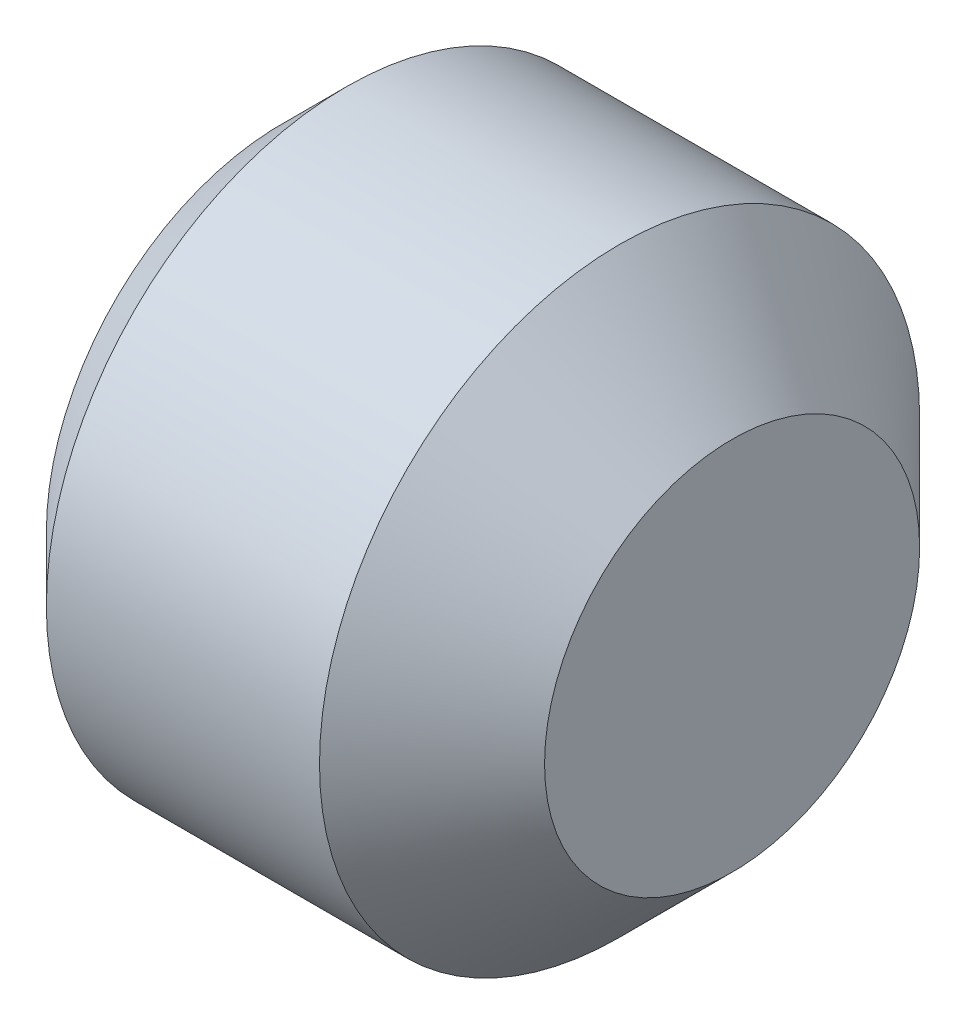
ISO-10303-21;
HEADER;
FILE_DESCRIPTION(('STEP AP214'),'2;1');
FILE_NAME('part.step','',(''),(''),'','','');
FILE_SCHEMA(('AUTOMOTIVE_DESIGN { 1 0 10303 214 1 1 1 1 }'));
ENDSEC;
DATA;
#1=APPLICATION_CONTEXT('core data for automotive mechanical design processes');
#2=APPLICATION_PROTOCOL_DEFINITION('international standard','automotive_design',2000,#1);
#3=PRODUCT_CONTEXT('',#1,'mechanical');
#4=PRODUCT('Part','Part','',(#3));
#5=PRODUCT_RELATED_PRODUCT_CATEGORY('part','',(#4));
#6=PRODUCT_DEFINITION_FORMATION('','',#4);
#7=PRODUCT_DEFINITION_CONTEXT('part definition',#1,'design');
#8=PRODUCT_DEFINITION('design','',#6,#7);
#9=PRODUCT_DEFINITION_SHAPE('','',#8);
#10=(LENGTH_UNIT() NAMED_UNIT(*) SI_UNIT(.MILLI.,.METRE.));
#11=(NAMED_UNIT(*) PLANE_ANGLE_UNIT() SI_UNIT($,.RADIAN.));
#12=(NAMED_UNIT(*) SI_UNIT($,.STERADIAN.) SOLID_ANGLE_UNIT());
#13=UNCERTAINTY_MEASURE_WITH_UNIT(LENGTH_MEASURE(1.E-05),#10,'distance_accuracy_value','');
#14=(GEOMETRIC_REPRESENTATION_CONTEXT(3) GLOBAL_UNCERTAINTY_ASSIGNED_CONTEXT((#13)) GLOBAL_UNIT_ASSIGNED_CONTEXT((#10,
#11,#12)) REPRESENTATION_CONTEXT('',''));
#15=CARTESIAN_POINT('',(0.,0.,0.));
#16=DIRECTION('',(0.,0.,1.));
#17=DIRECTION('',(1.,0.,0.));
#18=AXIS2_PLACEMENT_3D('',#15,#16,#17);
#19=CARTESIAN_POINT('',(-1.5,0.,0.));
#20=DIRECTION('',(-1.,0.,0.));
#21=DIRECTION('',(0.,0.,1.));
#22=AXIS2_PLACEMENT_3D('',#19,#20,#21);
#23=PLANE('',#22);
#24=CARTESIAN_POINT('',(-1.5,0.,0.));
#25=DIRECTION('',(-1.,0.,0.));
#26=DIRECTION('',(0.,0.,1.));
#27=AXIS2_PLACEMENT_3D('',#24,#25,#26);
#28=CIRCLE('',#27,1.);
#29=CARTESIAN_POINT('',(-1.5,0.500000000000029,0.866025403784422));
#30=VERTEX_POINT('',#29);
#31=CARTESIAN_POINT('',(-1.5,1.,0.));
#32=VERTEX_POINT('',#31);
#33=EDGE_CURVE('E46',#30,#32,#28,.T.);
#34=ORIENTED_EDGE('',*,*,#33,.F.);
#35=DIRECTION('',(0.,0.866025403784422,-0.500000000000029));
#36=VECTOR('',#35,1.);
#37=CARTESIAN_POINT('',(-1.5,0.,1.1547005383793));
#38=LINE('',#37,#36);
#39=CARTESIAN_POINT('',(-1.5,1.,0.57735026918963));
#40=VERTEX_POINT('',#39);
#41=EDGE_CURVE('E229',#30,#40,#38,.T.);
#42=ORIENTED_EDGE('',*,*,#41,.T.);
#43=DIRECTION('',(0.,0.,-1.));
#44=VECTOR('',#43,1.);
#45=CARTESIAN_POINT('',(-1.5,1.,0.57735026918963));
#46=LINE('',#45,#44);
#47=EDGE_CURVE('E222',#40,#32,#46,.T.);
#48=ORIENTED_EDGE('',*,*,#47,.T.);
#49=EDGE_LOOP('',(#34,#42,#48));
#50=FACE_BOUND('',#49,.T.);
#51=ADVANCED_FACE('F35',(#50),#23,.T.);
#52=CARTESIAN_POINT('',(-1.5,0.500000000000029,-0.866025403784422));
#53=VERTEX_POINT('',#52);
#54=EDGE_CURVE('E11',#32,#53,#28,.T.);
#55=ORIENTED_EDGE('',*,*,#54,.F.);
#56=CARTESIAN_POINT('',(-1.5,1.,-0.57735026918963));
#57=VERTEX_POINT('',#56);
#58=EDGE_CURVE('E225',#32,#57,#46,.T.);
#59=ORIENTED_EDGE('',*,*,#58,.T.);
#60=DIRECTION('',(0.,-0.866025403784422,-0.500000000000029));
#61=VECTOR('',#60,1.);
#62=CARTESIAN_POINT('',(-1.5,1.,-0.57735026918963));
#63=LINE('',#62,#61);
#64=EDGE_CURVE('E218',#57,#53,#63,.T.);
#65=ORIENTED_EDGE('',*,*,#64,.T.);
#66=EDGE_LOOP('',(#55,#59,#65));
#67=FACE_BOUND('',#66,.T.);
#68=ADVANCED_FACE('F122',(#67),#23,.T.);
#69=CARTESIAN_POINT('',(-1.5,-0.500000000000029,-0.866025403784422));
#70=VERTEX_POINT('',#69);
#71=EDGE_CURVE('E44',#53,#70,#28,.T.);
#72=ORIENTED_EDGE('',*,*,#71,.F.);
#73=CARTESIAN_POINT('',(-1.5,0.,-1.1547005383793));
#74=VERTEX_POINT('',#73);
#75=EDGE_CURVE('E221',#53,#74,#63,.T.);
#76=ORIENTED_EDGE('',*,*,#75,.T.);
#77=DIRECTION('',(0.,-0.866025403784422,0.500000000000029));
#78=VECTOR('',#77,1.);
#79=CARTESIAN_POINT('',(-1.5,0.,-1.1547005383793));
#80=LINE('',#79,#78);
#81=EDGE_CURVE('E189',#74,#70,#80,.T.);
#82=ORIENTED_EDGE('',*,*,#81,.T.);
#83=EDGE_LOOP('',(#72,#76,#82));
#84=FACE_BOUND('',#83,.T.);
#85=ADVANCED_FACE('F127',(#84),#23,.T.);
#86=CARTESIAN_POINT('',(-1.5,-1.,0.));
#87=VERTEX_POINT('',#86);
#88=EDGE_CURVE('E237',#70,#87,#28,.T.);
#89=ORIENTED_EDGE('',*,*,#88,.F.);
#90=CARTESIAN_POINT('',(-1.5,-1.,-0.57735026918963));
#91=VERTEX_POINT('',#90);
#92=EDGE_CURVE('E217',#70,#91,#80,.T.);
#93=ORIENTED_EDGE('',*,*,#92,.T.);
#94=DIRECTION('',(0.,0.,1.));
#95=VECTOR('',#94,1.);
#96=CARTESIAN_POINT('',(-1.5,-1.,-0.57735026918963));
#97=LINE('',#96,#95);
#98=EDGE_CURVE('E234',#91,#87,#97,.T.);
#99=ORIENTED_EDGE('',*,*,#98,.T.);
#100=EDGE_LOOP('',(#89,#93,#99));
#101=FACE_BOUND('',#100,.T.);
#102=ADVANCED_FACE('F244',(#101),#23,.T.);
#103=CARTESIAN_POINT('',(-1.5,-0.50000000000004,0.866025403784442));
#104=VERTEX_POINT('',#103);
#105=EDGE_CURVE('E53',#87,#104,#28,.T.);
#106=ORIENTED_EDGE('',*,*,#105,.F.);
#107=CARTESIAN_POINT('',(-1.5,-1.,0.57735026918963));
#108=VERTEX_POINT('',#107);
#109=EDGE_CURVE('E201',#87,#108,#97,.T.);
#110=ORIENTED_EDGE('',*,*,#109,.T.);
#111=DIRECTION('',(0.,0.866025403784422,0.500000000000029));
#112=VECTOR('',#111,1.);
#113=CARTESIAN_POINT('',(-1.5,-1.,0.57735026918963));
#114=LINE('',#113,#112);
#115=EDGE_CURVE('E230',#108,#104,#114,.T.);
#116=ORIENTED_EDGE('',*,*,#115,.T.);
#117=EDGE_LOOP('',(#106,#110,#116));
#118=FACE_BOUND('',#117,.T.);
#119=ADVANCED_FACE('F120',(#118),#23,.T.);
#120=CARTESIAN_POINT('',(-3.,0.,0.));
#121=DIRECTION('',(1.,0.,0.));
#122=DIRECTION('',(0.,0.,-1.));
#123=AXIS2_PLACEMENT_3D('',#120,#121,#122);
#124=PLANE('',#123);
#125=DIRECTION('',(0.,0.866025403784422,0.500000000000029));
#126=VECTOR('',#125,1.);
#127=CARTESIAN_POINT('',(-3.,-1.,0.57735026918963));
#128=LINE('',#127,#126);
#129=CARTESIAN_POINT('',(-3.,-1.,0.57735026918963));
#130=VERTEX_POINT('',#129);
#131=CARTESIAN_POINT('',(-3.,0.,1.1547005383793));
#132=VERTEX_POINT('',#131);
#133=EDGE_CURVE('E211',#130,#132,#128,.T.);
#134=ORIENTED_EDGE('',*,*,#133,.F.);
#135=DIRECTION('',(0.,0.,1.));
#136=VECTOR('',#135,1.);
#137=CARTESIAN_POINT('',(-3.,-1.,-0.57735026918963));
#138=LINE('',#137,#136);
#139=CARTESIAN_POINT('',(-3.,-1.,-0.57735026918963));
#140=VERTEX_POINT('',#139);
#141=EDGE_CURVE('E61',#140,#130,#138,.T.);
#142=ORIENTED_EDGE('',*,*,#141,.F.);
#143=DIRECTION('',(0.,-0.866025403784422,0.500000000000029));
#144=VECTOR('',#143,1.);
#145=CARTESIAN_POINT('',(-3.,0.,-1.1547005383793));
#146=LINE('',#145,#144);
#147=CARTESIAN_POINT('',(-3.,0.,-1.1547005383793));
#148=VERTEX_POINT('',#147);
#149=EDGE_CURVE('E198',#148,#140,#146,.T.);
#150=ORIENTED_EDGE('',*,*,#149,.F.);
#151=DIRECTION('',(0.,-0.866025403784422,-0.500000000000029));
#152=VECTOR('',#151,1.);
#153=CARTESIAN_POINT('',(-3.,1.,-0.57735026918963));
#154=LINE('',#153,#152);
#155=CARTESIAN_POINT('',(-3.,1.,-0.57735026918963));
#156=VERTEX_POINT('',#155);
#157=EDGE_CURVE('E202',#156,#148,#154,.T.);
#158=ORIENTED_EDGE('',*,*,#157,.F.);
#159=DIRECTION('',(0.,0.,-1.));
#160=VECTOR('',#159,1.);
#161=CARTESIAN_POINT('',(-3.,1.,0.57735026918963));
#162=LINE('',#161,#160);
#163=CARTESIAN_POINT('',(-3.,1.,0.57735026918963));
#164=VERTEX_POINT('',#163);
#165=EDGE_CURVE('E205',#164,#156,#162,.T.);
#166=ORIENTED_EDGE('',*,*,#165,.F.);
#167=DIRECTION('',(0.,0.866025403784422,-0.500000000000029));
#168=VECTOR('',#167,1.);
#169=CARTESIAN_POINT('',(-3.,0.,1.1547005383793));
#170=LINE('',#169,#168);
#171=EDGE_CURVE('E208',#132,#164,#170,.T.);
#172=ORIENTED_EDGE('',*,*,#171,.F.);
#173=EDGE_LOOP('',(#134,#142,#150,#158,#166,#172));
#174=FACE_BOUND('',#173,.T.);
#175=CARTESIAN_POINT('',(-3.,0.,0.));
#176=DIRECTION('',(-1.,0.,0.));
#177=DIRECTION('',(0.,0.,1.));
#178=AXIS2_PLACEMENT_3D('',#175,#176,#177);
#179=CIRCLE('',#178,1.5705);
#180=CARTESIAN_POINT('',(-3.,0.,1.5705));
#181=VERTEX_POINT('',#180);
#182=EDGE_CURVE('E39',#181,#181,#179,.T.);
#183=ORIENTED_EDGE('',*,*,#182,.T.);
#184=EDGE_LOOP('',(#183));
#185=FACE_BOUND('',#184,.T.);
#186=ADVANCED_FACE('F37',(#174,#185),#124,.F.);
#187=CARTESIAN_POINT('',(-2.5705,0.,0.));
#188=DIRECTION('',(1.,0.,0.));
#189=DIRECTION('',(0.,0.,-1.));
#190=AXIS2_PLACEMENT_3D('',#187,#188,#189);
#191=CONICAL_SURFACE('',#190,2.,0.785398163397448);
#192=ORIENTED_EDGE('',*,*,#182,.F.);
#193=EDGE_LOOP('',(#192));
#194=FACE_BOUND('',#193,.T.);
#195=CARTESIAN_POINT('',(-2.5705,0.,0.));
#196=DIRECTION('',(-1.,0.,0.));
#197=DIRECTION('',(0.,0.,1.));
#198=AXIS2_PLACEMENT_3D('',#195,#196,#197);
#199=CIRCLE('',#198,2.);
#200=CARTESIAN_POINT('',(-2.5705,0.,2.));
#201=VERTEX_POINT('',#200);
#202=EDGE_CURVE('E176',#201,#201,#199,.T.);
#203=ORIENTED_EDGE('',*,*,#202,.T.);
#204=EDGE_LOOP('',(#203));
#205=FACE_BOUND('',#204,.T.);
#206=ADVANCED_FACE('F163',(#194,#205),#191,.T.);
#207=CARTESIAN_POINT('',(0.,0.,0.));
#208=DIRECTION('',(-1.,0.,0.));
#209=DIRECTION('',(0.,0.,1.));
#210=AXIS2_PLACEMENT_3D('',#207,#208,#209);
#211=CYLINDRICAL_SURFACE('',#210,2.);
#212=ORIENTED_EDGE('',*,*,#202,.F.);
#213=EDGE_LOOP('',(#212));
#214=FACE_BOUND('',#213,.T.);
#215=CARTESIAN_POINT('',(-0.75,0.,0.));
#216=DIRECTION('',(-1.,0.,0.));
#217=DIRECTION('',(0.,0.,1.));
#218=AXIS2_PLACEMENT_3D('',#215,#216,#217);
#219=CIRCLE('',#218,2.);
#220=CARTESIAN_POINT('',(-0.75,0.,2.));
#221=VERTEX_POINT('',#220);
#222=EDGE_CURVE('E177',#221,#221,#219,.T.);
#223=ORIENTED_EDGE('',*,*,#222,.T.);
#224=EDGE_LOOP('',(#223));
#225=FACE_BOUND('',#224,.T.);
#226=ADVANCED_FACE('F160',(#214,#225),#211,.T.);
#227=CARTESIAN_POINT('',(0.,0.,0.));
#228=DIRECTION('',(-1.,0.,0.));
#229=DIRECTION('',(0.,0.,1.));
#230=AXIS2_PLACEMENT_3D('',#227,#228,#229);
#231=CONICAL_SURFACE('',#230,1.25,0.785398163397448);
#232=ORIENTED_EDGE('',*,*,#222,.F.);
#233=EDGE_LOOP('',(#232));
#234=FACE_BOUND('',#233,.T.);
#235=CARTESIAN_POINT('',(0.,0.,0.));
#236=DIRECTION('',(-1.,0.,0.));
#237=DIRECTION('',(0.,0.,1.));
#238=AXIS2_PLACEMENT_3D('',#235,#236,#237);
#239=CIRCLE('',#238,1.25);
#240=CARTESIAN_POINT('',(0.,0.,1.25));
#241=VERTEX_POINT('',#240);
#242=EDGE_CURVE('E180',#241,#241,#239,.T.);
#243=ORIENTED_EDGE('',*,*,#242,.T.);
#244=EDGE_LOOP('',(#243));
#245=FACE_BOUND('',#244,.T.);
#246=ADVANCED_FACE('F156',(#234,#245),#231,.T.);
#247=CARTESIAN_POINT('',(0.,1.25,0.));
#248=DIRECTION('',(-1.,0.,0.));
#249=DIRECTION('',(0.,0.,1.));
#250=AXIS2_PLACEMENT_3D('',#247,#248,#249);
#251=PLANE('',#250);
#252=ORIENTED_EDGE('',*,*,#242,.F.);
#253=EDGE_LOOP('',(#252));
#254=FACE_BOUND('',#253,.T.);
#255=ADVANCED_FACE('F153',(#254),#251,.F.);
#256=CARTESIAN_POINT('',(-1.5,-1.,-0.57735026918963));
#257=DIRECTION('',(0.,-1.,0.));
#258=DIRECTION('',(0.,0.,-1.));
#259=AXIS2_PLACEMENT_3D('',#256,#257,#258);
#260=PLANE('',#259);
#261=ORIENTED_EDGE('',*,*,#141,.T.);
#262=DIRECTION('',(-1.,0.,0.));
#263=VECTOR('',#262,1.);
#264=CARTESIAN_POINT('',(-1.5,-1.,0.57735026918963));
#265=LINE('',#264,#263);
#266=EDGE_CURVE('E186',#108,#130,#265,.T.);
#267=ORIENTED_EDGE('',*,*,#266,.F.);
#268=ORIENTED_EDGE('',*,*,#109,.F.);
#269=ORIENTED_EDGE('',*,*,#98,.F.);
#270=DIRECTION('',(-1.,0.,0.));
#271=VECTOR('',#270,1.);
#272=CARTESIAN_POINT('',(-1.5,-1.,-0.57735026918963));
#273=LINE('',#272,#271);
#274=EDGE_CURVE('E185',#91,#140,#273,.T.);
#275=ORIENTED_EDGE('',*,*,#274,.T.);
#276=EDGE_LOOP('',(#261,#267,#268,#269,#275));
#277=FACE_BOUND('',#276,.T.);
#278=ADVANCED_FACE('F135',(#277),#260,.F.);
#279=CARTESIAN_POINT('',(-1.5,0.,-1.1547005383793));
#280=DIRECTION('',(0.,-0.500000000000029,-0.866025403784422));
#281=DIRECTION('',(0.,0.866025403784422,-0.500000000000029));
#282=AXIS2_PLACEMENT_3D('',#279,#280,#281);
#283=PLANE('',#282);
#284=ORIENTED_EDGE('',*,*,#149,.T.);
#285=ORIENTED_EDGE('',*,*,#274,.F.);
#286=ORIENTED_EDGE('',*,*,#92,.F.);
#287=ORIENTED_EDGE('',*,*,#81,.F.);
#288=DIRECTION('',(-1.,0.,0.));
#289=VECTOR('',#288,1.);
#290=CARTESIAN_POINT('',(-1.5,0.,-1.1547005383793));
#291=LINE('',#290,#289);
#292=EDGE_CURVE('E195',#74,#148,#291,.T.);
#293=ORIENTED_EDGE('',*,*,#292,.T.);
#294=EDGE_LOOP('',(#284,#285,#286,#287,#293));
#295=FACE_BOUND('',#294,.T.);
#296=ADVANCED_FACE('F131',(#295),#283,.F.);
#297=CARTESIAN_POINT('',(-1.5,1.,-0.57735026918963));
#298=DIRECTION('',(0.,0.500000000000029,-0.866025403784422));
#299=DIRECTION('',(0.,0.866025403784422,0.500000000000029));
#300=AXIS2_PLACEMENT_3D('',#297,#298,#299);
#301=PLANE('',#300);
#302=ORIENTED_EDGE('',*,*,#157,.T.);
#303=ORIENTED_EDGE('',*,*,#292,.F.);
#304=ORIENTED_EDGE('',*,*,#75,.F.);
#305=ORIENTED_EDGE('',*,*,#64,.F.);
#306=DIRECTION('',(-1.,0.,0.));
#307=VECTOR('',#306,1.);
#308=CARTESIAN_POINT('',(-1.5,1.,-0.57735026918963));
#309=LINE('',#308,#307);
#310=EDGE_CURVE('E193',#57,#156,#309,.T.);
#311=ORIENTED_EDGE('',*,*,#310,.T.);
#312=EDGE_LOOP('',(#302,#303,#304,#305,#311));
#313=FACE_BOUND('',#312,.T.);
#314=ADVANCED_FACE('F134',(#313),#301,.F.);
#315=CARTESIAN_POINT('',(-1.5,1.,0.57735026918963));
#316=DIRECTION('',(0.,1.,0.));
#317=DIRECTION('',(0.,0.,1.));
#318=AXIS2_PLACEMENT_3D('',#315,#316,#317);
#319=PLANE('',#318);
#320=ORIENTED_EDGE('',*,*,#165,.T.);
#321=ORIENTED_EDGE('',*,*,#310,.F.);
#322=ORIENTED_EDGE('',*,*,#58,.F.);
#323=ORIENTED_EDGE('',*,*,#47,.F.);
#324=DIRECTION('',(-1.,0.,0.));
#325=VECTOR('',#324,1.);
#326=CARTESIAN_POINT('',(-1.5,1.,0.57735026918963));
#327=LINE('',#326,#325);
#328=EDGE_CURVE('E191',#40,#164,#327,.T.);
#329=ORIENTED_EDGE('',*,*,#328,.T.);
#330=EDGE_LOOP('',(#320,#321,#322,#323,#329));
#331=FACE_BOUND('',#330,.T.);
#332=ADVANCED_FACE('F139',(#331),#319,.F.);
#333=CARTESIAN_POINT('',(-1.5,0.,1.1547005383793));
#334=DIRECTION('',(0.,0.500000000000029,0.866025403784422));
#335=DIRECTION('',(0.,-0.866025403784422,0.500000000000029));
#336=AXIS2_PLACEMENT_3D('',#333,#334,#335);
#337=PLANE('',#336);
#338=ORIENTED_EDGE('',*,*,#171,.T.);
#339=ORIENTED_EDGE('',*,*,#328,.F.);
#340=ORIENTED_EDGE('',*,*,#41,.F.);
#341=CARTESIAN_POINT('',(-1.5,0.,1.1547005383793));
#342=VERTEX_POINT('',#341);
#343=EDGE_CURVE('E226',#342,#30,#38,.T.);
#344=ORIENTED_EDGE('',*,*,#343,.F.);
#345=DIRECTION('',(-1.,0.,0.));
#346=VECTOR('',#345,1.);
#347=CARTESIAN_POINT('',(-1.5,0.,1.1547005383793));
#348=LINE('',#347,#346);
#349=EDGE_CURVE('E188',#342,#132,#348,.T.);
#350=ORIENTED_EDGE('',*,*,#349,.T.);
#351=EDGE_LOOP('',(#338,#339,#340,#344,#350));
#352=FACE_BOUND('',#351,.T.);
#353=ADVANCED_FACE('F143',(#352),#337,.F.);
#354=CARTESIAN_POINT('',(-1.5,-1.,0.57735026918963));
#355=DIRECTION('',(0.,-0.500000000000029,0.866025403784422));
#356=DIRECTION('',(0.,-0.866025403784422,-0.500000000000029));
#357=AXIS2_PLACEMENT_3D('',#354,#355,#356);
#358=PLANE('',#357);
#359=ORIENTED_EDGE('',*,*,#133,.T.);
#360=ORIENTED_EDGE('',*,*,#349,.F.);
#361=EDGE_CURVE('E233',#104,#342,#114,.T.);
#362=ORIENTED_EDGE('',*,*,#361,.F.);
#363=ORIENTED_EDGE('',*,*,#115,.F.);
#364=ORIENTED_EDGE('',*,*,#266,.T.);
#365=EDGE_LOOP('',(#359,#360,#362,#363,#364));
#366=FACE_BOUND('',#365,.T.);
#367=ADVANCED_FACE('F117',(#366),#358,.F.);
#368=EDGE_CURVE('E178',#104,#30,#28,.T.);
#369=ORIENTED_EDGE('',*,*,#368,.F.);
#370=ORIENTED_EDGE('',*,*,#361,.T.);
#371=ORIENTED_EDGE('',*,*,#343,.T.);
#372=EDGE_LOOP('',(#369,#370,#371));
#373=FACE_BOUND('',#372,.T.);
#374=ADVANCED_FACE('F112',(#373),#23,.T.);
#375=CARTESIAN_POINT('',(-0.92264973081037,0.,0.));
#376=DIRECTION('',(-1.,0.,0.));
#377=DIRECTION('',(0.,0.,1.));
#378=AXIS2_PLACEMENT_3D('',#375,#376,#377);
#379=CONICAL_SURFACE('',#378,0.,1.04719755119659);
#380=ORIENTED_EDGE('',*,*,#33,.T.);
#381=ORIENTED_EDGE('',*,*,#54,.T.);
#382=ORIENTED_EDGE('',*,*,#71,.T.);
#383=ORIENTED_EDGE('',*,*,#88,.T.);
#384=ORIENTED_EDGE('',*,*,#105,.T.);
#385=ORIENTED_EDGE('',*,*,#368,.T.);
#386=EDGE_LOOP('',(#380,#381,#382,#383,#384,#385));
#387=FACE_BOUND('',#386,.T.);
#388=CARTESIAN_POINT('',(-0.92264973081037,0.,0.));
#389=VERTEX_POINT('',#388);
#390=VERTEX_LOOP('',#389);
#391=FACE_BOUND('',#390,.T.);
#392=ADVANCED_FACE('F110',(#387,#391),#379,.F.);
#393=CLOSED_SHELL('',(#51,#68,#85,#102,#119,#186,#206,#226,#246,#255,#278,#296,#314,#332,#353,
#367,#374,#392));
#394=MANIFOLD_SOLID_BREP('B2',#393);
#395=ADVANCED_BREP_SHAPE_REPRESENTATION('',(#18,#394),#14);
#396=SHAPE_DEFINITION_REPRESENTATION(#9,#395);
ENDSEC;
END-ISO-10303-21;
